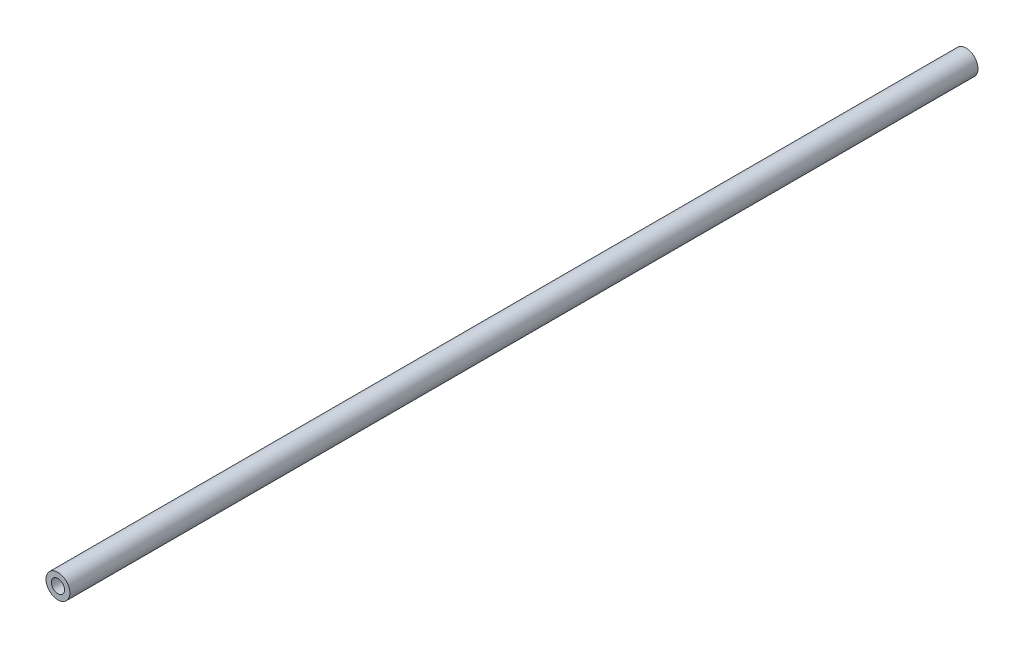
ISO-10303-21;
HEADER;
FILE_DESCRIPTION(('STEP AP214'),'2;1');
FILE_NAME('part.step','',(''),(''),'','','');
FILE_SCHEMA(('AUTOMOTIVE_DESIGN { 1 0 10303 214 1 1 1 1 }'));
ENDSEC;
DATA;
#1=APPLICATION_CONTEXT('core data for automotive mechanical design processes');
#2=APPLICATION_PROTOCOL_DEFINITION('international standard','automotive_design',2000,#1);
#3=PRODUCT_CONTEXT('',#1,'mechanical');
#4=PRODUCT('Part','Part','',(#3));
#5=PRODUCT_RELATED_PRODUCT_CATEGORY('part','',(#4));
#6=PRODUCT_DEFINITION_FORMATION('','',#4);
#7=PRODUCT_DEFINITION_CONTEXT('part definition',#1,'design');
#8=PRODUCT_DEFINITION('design','',#6,#7);
#9=PRODUCT_DEFINITION_SHAPE('','',#8);
#10=(LENGTH_UNIT() NAMED_UNIT(*) SI_UNIT(.MILLI.,.METRE.));
#11=(NAMED_UNIT(*) PLANE_ANGLE_UNIT() SI_UNIT($,.RADIAN.));
#12=(NAMED_UNIT(*) SI_UNIT($,.STERADIAN.) SOLID_ANGLE_UNIT());
#13=UNCERTAINTY_MEASURE_WITH_UNIT(LENGTH_MEASURE(1.E-05),#10,'distance_accuracy_value','');
#14=(GEOMETRIC_REPRESENTATION_CONTEXT(3) GLOBAL_UNCERTAINTY_ASSIGNED_CONTEXT((#13)) GLOBAL_UNIT_ASSIGNED_CONTEXT((#10,
#11,#12)) REPRESENTATION_CONTEXT('',''));
#15=CARTESIAN_POINT('',(0.,0.,0.));
#16=DIRECTION('',(0.,0.,1.));
#17=DIRECTION('',(1.,0.,0.));
#18=AXIS2_PLACEMENT_3D('',#15,#16,#17);
#19=CARTESIAN_POINT('',(0.,0.,241.3));
#20=DIRECTION('',(0.,0.,-1.));
#21=DIRECTION('',(-1.,0.,0.));
#22=AXIS2_PLACEMENT_3D('',#19,#20,#21);
#23=CYLINDRICAL_SURFACE('',#22,3.175);
#24=CARTESIAN_POINT('',(0.,0.,241.3));
#25=DIRECTION('',(0.,0.,1.));
#26=DIRECTION('',(1.,0.,0.));
#27=AXIS2_PLACEMENT_3D('',#24,#25,#26);
#28=CIRCLE('',#27,3.175);
#29=CARTESIAN_POINT('',(3.175,0.,241.3));
#30=VERTEX_POINT('',#29);
#31=EDGE_CURVE('E11',#30,#30,#28,.T.);
#32=ORIENTED_EDGE('',*,*,#31,.F.);
#33=EDGE_LOOP('',(#32));
#34=FACE_BOUND('',#33,.T.);
#35=CARTESIAN_POINT('',(0.,0.,0.));
#36=DIRECTION('',(0.,0.,1.));
#37=DIRECTION('',(1.,0.,0.));
#38=AXIS2_PLACEMENT_3D('',#35,#36,#37);
#39=CIRCLE('',#38,3.175);
#40=CARTESIAN_POINT('',(3.175,0.,0.));
#41=VERTEX_POINT('',#40);
#42=EDGE_CURVE('E36',#41,#41,#39,.T.);
#43=ORIENTED_EDGE('',*,*,#42,.T.);
#44=EDGE_LOOP('',(#43));
#45=FACE_BOUND('',#44,.T.);
#46=ADVANCED_FACE('F33',(#34,#45),#23,.T.);
#47=CARTESIAN_POINT('',(0.,0.,241.3));
#48=DIRECTION('',(0.,0.,1.));
#49=DIRECTION('',(1.,0.,0.));
#50=AXIS2_PLACEMENT_3D('',#47,#48,#49);
#51=PLANE('',#50);
#52=CARTESIAN_POINT('',(0.,0.,241.3));
#53=DIRECTION('',(0.,0.,1.));
#54=DIRECTION('',(1.,0.,0.));
#55=AXIS2_PLACEMENT_3D('',#52,#53,#54);
#56=CIRCLE('',#55,1.7526);
#57=CARTESIAN_POINT('',(1.7526,0.,241.3));
#58=VERTEX_POINT('',#57);
#59=EDGE_CURVE('E56',#58,#58,#56,.T.);
#60=ORIENTED_EDGE('',*,*,#59,.F.);
#61=EDGE_LOOP('',(#60));
#62=FACE_BOUND('',#61,.T.);
#63=ORIENTED_EDGE('',*,*,#31,.T.);
#64=EDGE_LOOP('',(#63));
#65=FACE_BOUND('',#64,.T.);
#66=ADVANCED_FACE('F83',(#62,#65),#51,.T.);
#67=CARTESIAN_POINT('',(0.,0.,0.));
#68=DIRECTION('',(0.,0.,1.));
#69=DIRECTION('',(1.,0.,0.));
#70=AXIS2_PLACEMENT_3D('',#67,#68,#69);
#71=PLANE('',#70);
#72=CARTESIAN_POINT('',(0.,0.,0.));
#73=DIRECTION('',(0.,0.,-1.));
#74=DIRECTION('',(-1.,0.,0.));
#75=AXIS2_PLACEMENT_3D('',#72,#73,#74);
#76=CIRCLE('',#75,1.75259999999999);
#77=CARTESIAN_POINT('',(-1.75259999999999,0.,0.));
#78=VERTEX_POINT('',#77);
#79=EDGE_CURVE('E184',#78,#78,#76,.T.);
#80=ORIENTED_EDGE('',*,*,#79,.F.);
#81=EDGE_LOOP('',(#80));
#82=FACE_BOUND('',#81,.T.);
#83=ORIENTED_EDGE('',*,*,#42,.F.);
#84=EDGE_LOOP('',(#83));
#85=FACE_BOUND('',#84,.T.);
#86=ADVANCED_FACE('F80',(#82,#85),#71,.F.);
#87=CARTESIAN_POINT('',(0.,0.,231.902));
#88=DIRECTION('',(0.,0.,1.));
#89=DIRECTION('',(1.,0.,0.));
#90=AXIS2_PLACEMENT_3D('',#87,#88,#89);
#91=CONICAL_SURFACE('',#90,1.35255,1.02974425867665);
#92=CARTESIAN_POINT('',(0.,0.,231.089305969734));
#93=VERTEX_POINT('',#92);
#94=VERTEX_LOOP('',#93);
#95=FACE_BOUND('',#94,.T.);
#96=CARTESIAN_POINT('',(0.,0.,231.902));
#97=DIRECTION('',(0.,0.,1.));
#98=DIRECTION('',(1.,0.,0.));
#99=AXIS2_PLACEMENT_3D('',#96,#97,#98);
#100=CIRCLE('',#99,1.35255);
#101=CARTESIAN_POINT('',(1.35255,0.,231.902));
#102=VERTEX_POINT('',#101);
#103=EDGE_CURVE('E72',#102,#102,#100,.T.);
#104=ORIENTED_EDGE('',*,*,#103,.T.);
#105=EDGE_LOOP('',(#104));
#106=FACE_BOUND('',#105,.T.);
#107=ADVANCED_FACE('F82',(#95,#106),#91,.F.);
#108=CARTESIAN_POINT('',(0.,0.,241.3));
#109=DIRECTION('',(0.,0.,1.));
#110=DIRECTION('',(1.,0.,0.));
#111=AXIS2_PLACEMENT_3D('',#108,#109,#110);
#112=CYLINDRICAL_SURFACE('',#111,1.35255);
#113=ORIENTED_EDGE('',*,*,#103,.F.);
#114=EDGE_LOOP('',(#113));
#115=FACE_BOUND('',#114,.T.);
#116=CARTESIAN_POINT('',(0.,0.,234.188));
#117=DIRECTION('',(0.,0.,1.));
#118=DIRECTION('',(1.,0.,0.));
#119=AXIS2_PLACEMENT_3D('',#116,#117,#118);
#120=CIRCLE('',#119,1.35255);
#121=CARTESIAN_POINT('',(1.35255,0.,234.188));
#122=VERTEX_POINT('',#121);
#123=EDGE_CURVE('E69',#122,#122,#120,.T.);
#124=ORIENTED_EDGE('',*,*,#123,.T.);
#125=EDGE_LOOP('',(#124));
#126=FACE_BOUND('',#125,.T.);
#127=ADVANCED_FACE('F89',(#115,#126),#112,.F.);
#128=CARTESIAN_POINT('',(1.35255,0.,234.188));
#129=DIRECTION('',(0.,0.,-1.));
#130=DIRECTION('',(-1.,0.,0.));
#131=AXIS2_PLACEMENT_3D('',#128,#129,#130);
#132=PLANE('',#131);
#133=ORIENTED_EDGE('',*,*,#123,.F.);
#134=EDGE_LOOP('',(#133));
#135=FACE_BOUND('',#134,.T.);
#136=CARTESIAN_POINT('',(0.,0.,234.188));
#137=DIRECTION('',(0.,0.,1.));
#138=DIRECTION('',(1.,0.,0.));
#139=AXIS2_PLACEMENT_3D('',#136,#137,#138);
#140=CIRCLE('',#139,1.7526);
#141=CARTESIAN_POINT('',(1.7526,0.,234.188));
#142=VERTEX_POINT('',#141);
#143=EDGE_CURVE('E60',#142,#142,#140,.T.);
#144=ORIENTED_EDGE('',*,*,#143,.T.);
#145=EDGE_LOOP('',(#144));
#146=FACE_BOUND('',#145,.T.);
#147=ADVANCED_FACE('F120',(#135,#146),#132,.F.);
#148=CARTESIAN_POINT('',(0.,0.,241.3));
#149=DIRECTION('',(0.,0.,1.));
#150=DIRECTION('',(1.,0.,0.));
#151=AXIS2_PLACEMENT_3D('',#148,#149,#150);
#152=CYLINDRICAL_SURFACE('',#151,1.7526);
#153=ORIENTED_EDGE('',*,*,#143,.F.);
#154=EDGE_LOOP('',(#153));
#155=FACE_BOUND('',#154,.T.);
#156=ORIENTED_EDGE('',*,*,#59,.T.);
#157=EDGE_LOOP('',(#156));
#158=FACE_BOUND('',#157,.T.);
#159=ADVANCED_FACE('F50',(#155,#158),#152,.F.);
#160=CARTESIAN_POINT('',(0.,0.,9.39799999999999));
#161=DIRECTION('',(0.,0.,-1.));
#162=DIRECTION('',(-1.,0.,0.));
#163=AXIS2_PLACEMENT_3D('',#160,#161,#162);
#164=CONICAL_SURFACE('',#163,1.35255,1.02974425867665);
#165=CARTESIAN_POINT('',(0.,0.,10.2106940302657));
#166=VERTEX_POINT('',#165);
#167=VERTEX_LOOP('',#166);
#168=FACE_BOUND('',#167,.T.);
#169=CARTESIAN_POINT('',(0.,0.,9.39799999999999));
#170=DIRECTION('',(0.,0.,-1.));
#171=DIRECTION('',(-1.,0.,0.));
#172=AXIS2_PLACEMENT_3D('',#169,#170,#171);
#173=CIRCLE('',#172,1.35255);
#174=CARTESIAN_POINT('',(-1.35255,0.,9.39799999999999));
#175=VERTEX_POINT('',#174);
#176=EDGE_CURVE('E54',#175,#175,#173,.T.);
#177=ORIENTED_EDGE('',*,*,#176,.T.);
#178=EDGE_LOOP('',(#177));
#179=FACE_BOUND('',#178,.T.);
#180=ADVANCED_FACE('F46',(#168,#179),#164,.F.);
#181=CARTESIAN_POINT('',(0.,0.,0.));
#182=DIRECTION('',(0.,0.,-1.));
#183=DIRECTION('',(-1.,0.,0.));
#184=AXIS2_PLACEMENT_3D('',#181,#182,#183);
#185=CYLINDRICAL_SURFACE('',#184,1.35255);
#186=ORIENTED_EDGE('',*,*,#176,.F.);
#187=EDGE_LOOP('',(#186));
#188=FACE_BOUND('',#187,.T.);
#189=CARTESIAN_POINT('',(0.,0.,7.112));
#190=DIRECTION('',(0.,0.,-1.));
#191=DIRECTION('',(-1.,0.,0.));
#192=AXIS2_PLACEMENT_3D('',#189,#190,#191);
#193=CIRCLE('',#192,1.35255);
#194=CARTESIAN_POINT('',(-1.35255,0.,7.112));
#195=VERTEX_POINT('',#194);
#196=EDGE_CURVE('E57',#195,#195,#193,.T.);
#197=ORIENTED_EDGE('',*,*,#196,.T.);
#198=EDGE_LOOP('',(#197));
#199=FACE_BOUND('',#198,.T.);
#200=ADVANCED_FACE('F49',(#188,#199),#185,.F.);
#201=CARTESIAN_POINT('',(1.35255,0.,7.112));
#202=DIRECTION('',(0.,0.,1.));
#203=DIRECTION('',(1.,0.,0.));
#204=AXIS2_PLACEMENT_3D('',#201,#202,#203);
#205=PLANE('',#204);
#206=ORIENTED_EDGE('',*,*,#196,.F.);
#207=EDGE_LOOP('',(#206));
#208=FACE_BOUND('',#207,.T.);
#209=CARTESIAN_POINT('',(0.,0.,7.112));
#210=DIRECTION('',(0.,0.,-1.));
#211=DIRECTION('',(-1.,0.,0.));
#212=AXIS2_PLACEMENT_3D('',#209,#210,#211);
#213=CIRCLE('',#212,1.75259999999999);
#214=CARTESIAN_POINT('',(-1.75259999999999,0.,7.112));
#215=VERTEX_POINT('',#214);
#216=EDGE_CURVE('E63',#215,#215,#213,.T.);
#217=ORIENTED_EDGE('',*,*,#216,.T.);
#218=EDGE_LOOP('',(#217));
#219=FACE_BOUND('',#218,.T.);
#220=ADVANCED_FACE('F157',(#208,#219),#205,.F.);
#221=CARTESIAN_POINT('',(0.,0.,0.));
#222=DIRECTION('',(0.,0.,-1.));
#223=DIRECTION('',(-1.,0.,0.));
#224=AXIS2_PLACEMENT_3D('',#221,#222,#223);
#225=CYLINDRICAL_SURFACE('',#224,1.75259999999999);
#226=ORIENTED_EDGE('',*,*,#216,.F.);
#227=EDGE_LOOP('',(#226));
#228=FACE_BOUND('',#227,.T.);
#229=ORIENTED_EDGE('',*,*,#79,.T.);
#230=EDGE_LOOP('',(#229));
#231=FACE_BOUND('',#230,.T.);
#232=ADVANCED_FACE('F166',(#228,#231),#225,.F.);
#233=CLOSED_SHELL('',(#46,#66,#86,#107,#127,#147,#159,#180,#200,#220,#232));
#234=MANIFOLD_SOLID_BREP('B2',#233);
#235=ADVANCED_BREP_SHAPE_REPRESENTATION('',(#18,#234),#14);
#236=SHAPE_DEFINITION_REPRESENTATION(#9,#235);
ENDSEC;
END-ISO-10303-21;
